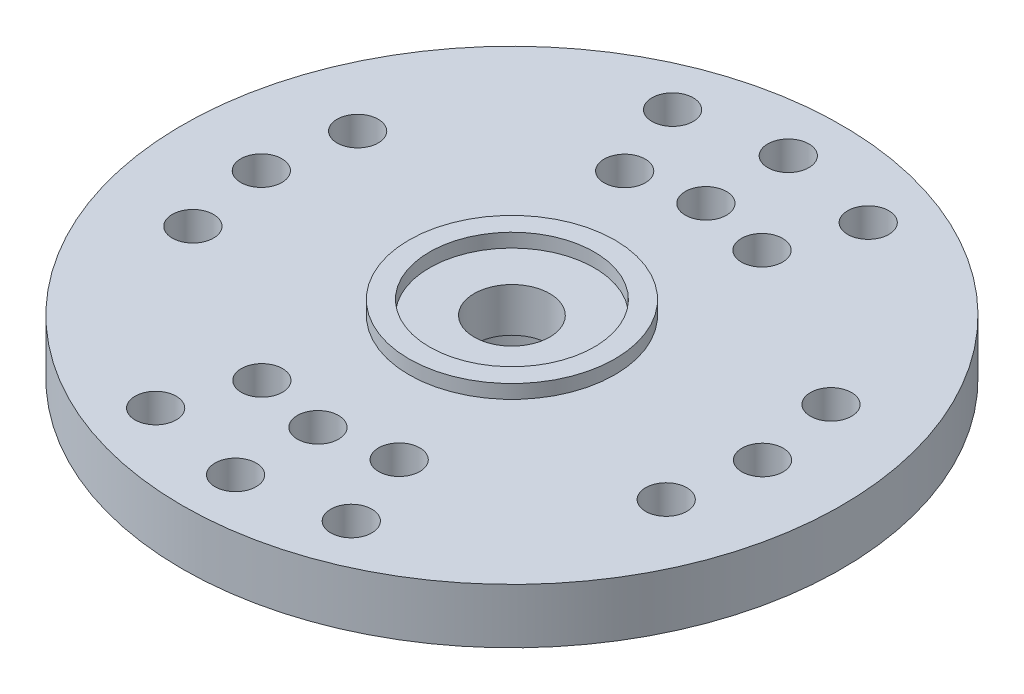
ISO-10303-21;
HEADER;
FILE_DESCRIPTION(('STEP AP214'),'2;1');
FILE_NAME('part.step','',(''),(''),'','','');
FILE_SCHEMA(('AUTOMOTIVE_DESIGN { 1 0 10303 214 1 1 1 1 }'));
ENDSEC;
DATA;
#1=APPLICATION_CONTEXT('core data for automotive mechanical design processes');
#2=APPLICATION_PROTOCOL_DEFINITION('international standard','automotive_design',2000,#1);
#3=PRODUCT_CONTEXT('',#1,'mechanical');
#4=PRODUCT('Part','Part','',(#3));
#5=PRODUCT_RELATED_PRODUCT_CATEGORY('part','',(#4));
#6=PRODUCT_DEFINITION_FORMATION('','',#4);
#7=PRODUCT_DEFINITION_CONTEXT('part definition',#1,'design');
#8=PRODUCT_DEFINITION('design','',#6,#7);
#9=PRODUCT_DEFINITION_SHAPE('','',#8);
#10=(LENGTH_UNIT() NAMED_UNIT(*) SI_UNIT(.MILLI.,.METRE.));
#11=(NAMED_UNIT(*) PLANE_ANGLE_UNIT() SI_UNIT($,.RADIAN.));
#12=(NAMED_UNIT(*) SI_UNIT($,.STERADIAN.) SOLID_ANGLE_UNIT());
#13=UNCERTAINTY_MEASURE_WITH_UNIT(LENGTH_MEASURE(1.E-05),#10,'distance_accuracy_value','');
#14=(GEOMETRIC_REPRESENTATION_CONTEXT(3) GLOBAL_UNCERTAINTY_ASSIGNED_CONTEXT((#13)) GLOBAL_UNIT_ASSIGNED_CONTEXT((#10,
#11,#12)) REPRESENTATION_CONTEXT('',''));
#15=CARTESIAN_POINT('',(0.,0.,0.));
#16=DIRECTION('',(0.,0.,1.));
#17=DIRECTION('',(1.,0.,0.));
#18=AXIS2_PLACEMENT_3D('',#15,#16,#17);
#19=CARTESIAN_POINT('',(0.,0.4,0.));
#20=DIRECTION('',(0.,1.,0.));
#21=DIRECTION('',(0.,0.,1.));
#22=AXIS2_PLACEMENT_3D('',#19,#20,#21);
#23=PLANE('',#22);
#24=CARTESIAN_POINT('',(0.,0.4,0.));
#25=DIRECTION('',(0.,1.,0.));
#26=DIRECTION('',(0.,0.,1.));
#27=AXIS2_PLACEMENT_3D('',#24,#25,#26);
#28=CIRCLE('',#27,1.375);
#29=CARTESIAN_POINT('',(0.,0.4,1.375));
#30=VERTEX_POINT('',#29);
#31=EDGE_CURVE('E16',#30,#30,#28,.T.);
#32=ORIENTED_EDGE('',*,*,#31,.T.);
#33=EDGE_LOOP('',(#32));
#34=FACE_BOUND('',#33,.T.);
#35=CARTESIAN_POINT('',(0.,0.4,0.));
#36=DIRECTION('',(0.,1.,0.));
#37=DIRECTION('',(0.,0.,1.));
#38=AXIS2_PLACEMENT_3D('',#35,#36,#37);
#39=CIRCLE('',#38,2.85);
#40=CARTESIAN_POINT('',(0.,0.4,2.85));
#41=VERTEX_POINT('',#40);
#42=EDGE_CURVE('E158',#41,#41,#39,.F.);
#43=ORIENTED_EDGE('',*,*,#42,.T.);
#44=EDGE_LOOP('',(#43));
#45=FACE_BOUND('',#44,.T.);
#46=ADVANCED_FACE('F13',(#34,#45),#23,.F.);
#47=CARTESIAN_POINT('',(0.,-2.6,0.));
#48=DIRECTION('',(0.,1.,0.));
#49=DIRECTION('',(0.,0.,1.));
#50=AXIS2_PLACEMENT_3D('',#47,#48,#49);
#51=CYLINDRICAL_SURFACE('',#50,1.375);
#52=CARTESIAN_POINT('',(0.,2.,0.));
#53=DIRECTION('',(0.,1.,0.));
#54=DIRECTION('',(0.,0.,1.));
#55=AXIS2_PLACEMENT_3D('',#52,#53,#54);
#56=CIRCLE('',#55,1.375);
#57=CARTESIAN_POINT('',(0.,2.,1.375));
#58=VERTEX_POINT('',#57);
#59=EDGE_CURVE('E156',#58,#58,#56,.F.);
#60=ORIENTED_EDGE('',*,*,#59,.F.);
#61=EDGE_LOOP('',(#60));
#62=FACE_BOUND('',#61,.T.);
#63=ORIENTED_EDGE('',*,*,#31,.F.);
#64=EDGE_LOOP('',(#63));
#65=FACE_BOUND('',#64,.T.);
#66=ADVANCED_FACE('F166',(#62,#65),#51,.F.);
#67=CARTESIAN_POINT('',(0.,-2.6,0.));
#68=DIRECTION('',(0.,1.,0.));
#69=DIRECTION('',(0.,0.,1.));
#70=AXIS2_PLACEMENT_3D('',#67,#68,#69);
#71=CYLINDRICAL_SURFACE('',#70,2.85);
#72=ORIENTED_EDGE('',*,*,#42,.F.);
#73=EDGE_LOOP('',(#72));
#74=FACE_BOUND('',#73,.T.);
#75=CARTESIAN_POINT('',(0.,-2.6,0.));
#76=DIRECTION('',(0.,1.,0.));
#77=DIRECTION('',(0.,0.,1.));
#78=AXIS2_PLACEMENT_3D('',#75,#76,#77);
#79=CIRCLE('',#78,2.85);
#80=CARTESIAN_POINT('',(0.,-2.6,2.85));
#81=VERTEX_POINT('',#80);
#82=EDGE_CURVE('E153',#81,#81,#79,.F.);
#83=ORIENTED_EDGE('',*,*,#82,.T.);
#84=EDGE_LOOP('',(#83));
#85=FACE_BOUND('',#84,.T.);
#86=ADVANCED_FACE('F168',(#74,#85),#71,.F.);
#87=CARTESIAN_POINT('',(0.,2.,0.));
#88=DIRECTION('',(0.,1.,0.));
#89=DIRECTION('',(0.,0.,1.));
#90=AXIS2_PLACEMENT_3D('',#87,#88,#89);
#91=PLANE('',#90);
#92=ORIENTED_EDGE('',*,*,#59,.T.);
#93=EDGE_LOOP('',(#92));
#94=FACE_BOUND('',#93,.T.);
#95=CARTESIAN_POINT('',(0.,2.,0.));
#96=DIRECTION('',(0.,1.,0.));
#97=DIRECTION('',(0.,0.,1.));
#98=AXIS2_PLACEMENT_3D('',#95,#96,#97);
#99=CIRCLE('',#98,3.);
#100=CARTESIAN_POINT('',(0.,2.,3.));
#101=VERTEX_POINT('',#100);
#102=EDGE_CURVE('E150',#101,#101,#99,.T.);
#103=ORIENTED_EDGE('',*,*,#102,.T.);
#104=EDGE_LOOP('',(#103));
#105=FACE_BOUND('',#104,.T.);
#106=ADVANCED_FACE('F175',(#94,#105),#91,.T.);
#107=CARTESIAN_POINT('',(0.,-2.6,0.));
#108=DIRECTION('',(0.,1.,0.));
#109=DIRECTION('',(0.,0.,1.));
#110=AXIS2_PLACEMENT_3D('',#107,#108,#109);
#111=PLANE('',#110);
#112=ORIENTED_EDGE('',*,*,#82,.F.);
#113=EDGE_LOOP('',(#112));
#114=FACE_BOUND('',#113,.T.);
#115=CARTESIAN_POINT('',(0.,-2.6,0.));
#116=DIRECTION('',(0.,1.,0.));
#117=DIRECTION('',(0.,0.,1.));
#118=AXIS2_PLACEMENT_3D('',#115,#116,#117);
#119=CIRCLE('',#118,4.45);
#120=CARTESIAN_POINT('',(0.,-2.6,4.45));
#121=VERTEX_POINT('',#120);
#122=EDGE_CURVE('E147',#121,#121,#119,.T.);
#123=ORIENTED_EDGE('',*,*,#122,.F.);
#124=EDGE_LOOP('',(#123));
#125=FACE_BOUND('',#124,.T.);
#126=ADVANCED_FACE('F281',(#114,#125),#111,.F.);
#127=CARTESIAN_POINT('',(0.,2.,0.));
#128=DIRECTION('',(0.,1.,0.));
#129=DIRECTION('',(0.,0.,1.));
#130=AXIS2_PLACEMENT_3D('',#127,#128,#129);
#131=CYLINDRICAL_SURFACE('',#130,3.);
#132=CARTESIAN_POINT('',(0.,2.5,0.));
#133=DIRECTION('',(0.,1.,0.));
#134=DIRECTION('',(0.,0.,1.));
#135=AXIS2_PLACEMENT_3D('',#132,#133,#134);
#136=CIRCLE('',#135,3.);
#137=CARTESIAN_POINT('',(0.,2.5,3.));
#138=VERTEX_POINT('',#137);
#139=EDGE_CURVE('E144',#138,#138,#136,.F.);
#140=ORIENTED_EDGE('',*,*,#139,.F.);
#141=EDGE_LOOP('',(#140));
#142=FACE_BOUND('',#141,.T.);
#143=ORIENTED_EDGE('',*,*,#102,.F.);
#144=EDGE_LOOP('',(#143));
#145=FACE_BOUND('',#144,.T.);
#146=ADVANCED_FACE('F277',(#142,#145),#131,.F.);
#147=CARTESIAN_POINT('',(0.,0.,0.));
#148=DIRECTION('',(0.,1.,0.));
#149=DIRECTION('',(0.,0.,1.));
#150=AXIS2_PLACEMENT_3D('',#147,#148,#149);
#151=CYLINDRICAL_SURFACE('',#150,4.45);
#152=ORIENTED_EDGE('',*,*,#122,.T.);
#153=EDGE_LOOP('',(#152));
#154=FACE_BOUND('',#153,.T.);
#155=CARTESIAN_POINT('',(0.,0.,0.));
#156=DIRECTION('',(0.,1.,0.));
#157=DIRECTION('',(0.,0.,1.));
#158=AXIS2_PLACEMENT_3D('',#155,#156,#157);
#159=CIRCLE('',#158,4.45);
#160=CARTESIAN_POINT('',(0.,0.,4.45));
#161=VERTEX_POINT('',#160);
#162=EDGE_CURVE('E141',#161,#161,#159,.F.);
#163=ORIENTED_EDGE('',*,*,#162,.T.);
#164=EDGE_LOOP('',(#163));
#165=FACE_BOUND('',#164,.T.);
#166=ADVANCED_FACE('F273',(#154,#165),#151,.T.);
#167=CARTESIAN_POINT('',(0.,2.5,0.));
#168=DIRECTION('',(0.,1.,0.));
#169=DIRECTION('',(0.,0.,1.));
#170=AXIS2_PLACEMENT_3D('',#167,#168,#169);
#171=PLANE('',#170);
#172=ORIENTED_EDGE('',*,*,#139,.T.);
#173=EDGE_LOOP('',(#172));
#174=FACE_BOUND('',#173,.T.);
#175=CARTESIAN_POINT('',(0.,2.5,0.));
#176=DIRECTION('',(0.,1.,0.));
#177=DIRECTION('',(0.,0.,1.));
#178=AXIS2_PLACEMENT_3D('',#175,#176,#177);
#179=CIRCLE('',#178,3.75);
#180=CARTESIAN_POINT('',(0.,2.5,3.75));
#181=VERTEX_POINT('',#180);
#182=EDGE_CURVE('E135',#181,#181,#179,.F.);
#183=ORIENTED_EDGE('',*,*,#182,.F.);
#184=EDGE_LOOP('',(#183));
#185=FACE_BOUND('',#184,.T.);
#186=ADVANCED_FACE('F269',(#174,#185),#171,.T.);
#187=CARTESIAN_POINT('',(0.,0.,0.));
#188=DIRECTION('',(0.,1.,0.));
#189=DIRECTION('',(0.,0.,1.));
#190=AXIS2_PLACEMENT_3D('',#187,#188,#189);
#191=PLANE('',#190);
#192=CARTESIAN_POINT('',(-3.56194690265486,0.,9.41097447200168));
#193=DIRECTION('',(0.,1.,0.));
#194=DIRECTION('',(0.,0.,1.));
#195=AXIS2_PLACEMENT_3D('',#192,#193,#194);
#196=CIRCLE('',#195,0.75);
#197=CARTESIAN_POINT('',(-3.56194690265486,0.,10.1609744720017));
#198=VERTEX_POINT('',#197);
#199=EDGE_CURVE('E81',#198,#198,#196,.T.);
#200=ORIENTED_EDGE('',*,*,#199,.T.);
#201=EDGE_LOOP('',(#200));
#202=FACE_BOUND('',#201,.T.);
#203=CARTESIAN_POINT('',(3.56194690265486,0.,9.41097447200168));
#204=DIRECTION('',(0.,1.,0.));
#205=DIRECTION('',(0.,0.,1.));
#206=AXIS2_PLACEMENT_3D('',#203,#204,#205);
#207=CIRCLE('',#206,0.75);
#208=CARTESIAN_POINT('',(3.56194690265486,0.,10.1609744720017));
#209=VERTEX_POINT('',#208);
#210=EDGE_CURVE('E84',#209,#209,#207,.T.);
#211=ORIENTED_EDGE('',*,*,#210,.T.);
#212=EDGE_LOOP('',(#211));
#213=FACE_BOUND('',#212,.T.);
#214=CARTESIAN_POINT('',(-3.56194690265486,0.,-9.41097447200168));
#215=DIRECTION('',(0.,1.,0.));
#216=DIRECTION('',(0.,0.,1.));
#217=AXIS2_PLACEMENT_3D('',#214,#215,#216);
#218=CIRCLE('',#217,0.75);
#219=CARTESIAN_POINT('',(-3.56194690265486,0.,-8.66097447200168));
#220=VERTEX_POINT('',#219);
#221=EDGE_CURVE('E87',#220,#220,#218,.T.);
#222=ORIENTED_EDGE('',*,*,#221,.T.);
#223=EDGE_LOOP('',(#222));
#224=FACE_BOUND('',#223,.T.);
#225=CARTESIAN_POINT('',(3.56194690265486,0.,-9.41097447200168));
#226=DIRECTION('',(0.,1.,0.));
#227=DIRECTION('',(0.,0.,1.));
#228=AXIS2_PLACEMENT_3D('',#225,#226,#227);
#229=CIRCLE('',#228,0.75);
#230=CARTESIAN_POINT('',(3.56194690265486,0.,-8.66097447200168));
#231=VERTEX_POINT('',#230);
#232=EDGE_CURVE('E90',#231,#231,#229,.T.);
#233=ORIENTED_EDGE('',*,*,#232,.T.);
#234=EDGE_LOOP('',(#233));
#235=FACE_BOUND('',#234,.T.);
#236=CARTESIAN_POINT('',(0.,0.,10.0625));
#237=DIRECTION('',(0.,1.,0.));
#238=DIRECTION('',(0.,0.,1.));
#239=AXIS2_PLACEMENT_3D('',#236,#237,#238);
#240=CIRCLE('',#239,0.75);
#241=CARTESIAN_POINT('',(0.,0.,10.8125));
#242=VERTEX_POINT('',#241);
#243=EDGE_CURVE('E93',#242,#242,#240,.T.);
#244=ORIENTED_EDGE('',*,*,#243,.T.);
#245=EDGE_LOOP('',(#244));
#246=FACE_BOUND('',#245,.T.);
#247=CARTESIAN_POINT('',(0.,0.,-10.0625));
#248=DIRECTION('',(0.,1.,0.));
#249=DIRECTION('',(0.,0.,1.));
#250=AXIS2_PLACEMENT_3D('',#247,#248,#249);
#251=CIRCLE('',#250,0.75);
#252=CARTESIAN_POINT('',(0.,0.,-9.31249999999999));
#253=VERTEX_POINT('',#252);
#254=EDGE_CURVE('E96',#253,#253,#251,.T.);
#255=ORIENTED_EDGE('',*,*,#254,.T.);
#256=EDGE_LOOP('',(#255));
#257=FACE_BOUND('',#256,.T.);
#258=CARTESIAN_POINT('',(-2.5,0.,6.60521810767821));
#259=DIRECTION('',(0.,1.,0.));
#260=DIRECTION('',(0.,0.,1.));
#261=AXIS2_PLACEMENT_3D('',#258,#259,#260);
#262=CIRCLE('',#261,0.75);
#263=CARTESIAN_POINT('',(-2.5,0.,7.35521810767821));
#264=VERTEX_POINT('',#263);
#265=EDGE_CURVE('E99',#264,#264,#262,.T.);
#266=ORIENTED_EDGE('',*,*,#265,.T.);
#267=EDGE_LOOP('',(#266));
#268=FACE_BOUND('',#267,.T.);
#269=CARTESIAN_POINT('',(2.5,0.,6.60521810767821));
#270=DIRECTION('',(0.,1.,0.));
#271=DIRECTION('',(0.,0.,1.));
#272=AXIS2_PLACEMENT_3D('',#269,#270,#271);
#273=CIRCLE('',#272,0.75);
#274=CARTESIAN_POINT('',(2.5,0.,7.35521810767821));
#275=VERTEX_POINT('',#274);
#276=EDGE_CURVE('E102',#275,#275,#273,.T.);
#277=ORIENTED_EDGE('',*,*,#276,.T.);
#278=EDGE_LOOP('',(#277));
#279=FACE_BOUND('',#278,.T.);
#280=CARTESIAN_POINT('',(-2.5,0.,-6.60521810767821));
#281=DIRECTION('',(0.,1.,0.));
#282=DIRECTION('',(0.,0.,1.));
#283=AXIS2_PLACEMENT_3D('',#280,#281,#282);
#284=CIRCLE('',#283,0.75);
#285=CARTESIAN_POINT('',(-2.5,0.,-5.85521810767821));
#286=VERTEX_POINT('',#285);
#287=EDGE_CURVE('E105',#286,#286,#284,.T.);
#288=ORIENTED_EDGE('',*,*,#287,.T.);
#289=EDGE_LOOP('',(#288));
#290=FACE_BOUND('',#289,.T.);
#291=CARTESIAN_POINT('',(2.5,0.,-6.60521810767821));
#292=DIRECTION('',(0.,1.,0.));
#293=DIRECTION('',(0.,0.,1.));
#294=AXIS2_PLACEMENT_3D('',#291,#292,#293);
#295=CIRCLE('',#294,0.75);
#296=CARTESIAN_POINT('',(2.5,0.,-5.85521810767821));
#297=VERTEX_POINT('',#296);
#298=EDGE_CURVE('E108',#297,#297,#295,.T.);
#299=ORIENTED_EDGE('',*,*,#298,.T.);
#300=EDGE_LOOP('',(#299));
#301=FACE_BOUND('',#300,.T.);
#302=CARTESIAN_POINT('',(0.,0.,7.0625));
#303=DIRECTION('',(0.,1.,0.));
#304=DIRECTION('',(0.,0.,1.));
#305=AXIS2_PLACEMENT_3D('',#302,#303,#304);
#306=CIRCLE('',#305,0.75);
#307=CARTESIAN_POINT('',(0.,0.,7.8125));
#308=VERTEX_POINT('',#307);
#309=EDGE_CURVE('E111',#308,#308,#306,.T.);
#310=ORIENTED_EDGE('',*,*,#309,.T.);
#311=EDGE_LOOP('',(#310));
#312=FACE_BOUND('',#311,.T.);
#313=CARTESIAN_POINT('',(0.,0.,-7.0625));
#314=DIRECTION('',(0.,1.,0.));
#315=DIRECTION('',(0.,0.,1.));
#316=AXIS2_PLACEMENT_3D('',#313,#314,#315);
#317=CIRCLE('',#316,0.75);
#318=CARTESIAN_POINT('',(0.,0.,-6.3125));
#319=VERTEX_POINT('',#318);
#320=EDGE_CURVE('E114',#319,#319,#317,.T.);
#321=ORIENTED_EDGE('',*,*,#320,.T.);
#322=EDGE_LOOP('',(#321));
#323=FACE_BOUND('',#322,.T.);
#324=CARTESIAN_POINT('',(-8.61775057657159,0.,-3.));
#325=DIRECTION('',(0.,1.,0.));
#326=DIRECTION('',(0.,0.,1.));
#327=AXIS2_PLACEMENT_3D('',#324,#325,#326);
#328=CIRCLE('',#327,0.75);
#329=CARTESIAN_POINT('',(-8.61775057657159,0.,-2.25));
#330=VERTEX_POINT('',#329);
#331=EDGE_CURVE('E117',#330,#330,#328,.T.);
#332=ORIENTED_EDGE('',*,*,#331,.T.);
#333=EDGE_LOOP('',(#332));
#334=FACE_BOUND('',#333,.T.);
#335=CARTESIAN_POINT('',(-8.61775057657159,0.,3.));
#336=DIRECTION('',(0.,1.,0.));
#337=DIRECTION('',(0.,0.,1.));
#338=AXIS2_PLACEMENT_3D('',#335,#336,#337);
#339=CIRCLE('',#338,0.75);
#340=CARTESIAN_POINT('',(-8.61775057657159,0.,3.75));
#341=VERTEX_POINT('',#340);
#342=EDGE_CURVE('E120',#341,#341,#339,.T.);
#343=ORIENTED_EDGE('',*,*,#342,.T.);
#344=EDGE_LOOP('',(#343));
#345=FACE_BOUND('',#344,.T.);
#346=CARTESIAN_POINT('',(8.61775057657159,0.,-3.));
#347=DIRECTION('',(0.,1.,0.));
#348=DIRECTION('',(0.,0.,1.));
#349=AXIS2_PLACEMENT_3D('',#346,#347,#348);
#350=CIRCLE('',#349,0.75);
#351=CARTESIAN_POINT('',(8.61775057657159,0.,-2.25));
#352=VERTEX_POINT('',#351);
#353=EDGE_CURVE('E123',#352,#352,#350,.T.);
#354=ORIENTED_EDGE('',*,*,#353,.T.);
#355=EDGE_LOOP('',(#354));
#356=FACE_BOUND('',#355,.T.);
#357=CARTESIAN_POINT('',(8.61775057657159,0.,3.));
#358=DIRECTION('',(0.,1.,0.));
#359=DIRECTION('',(0.,0.,1.));
#360=AXIS2_PLACEMENT_3D('',#357,#358,#359);
#361=CIRCLE('',#360,0.75);
#362=CARTESIAN_POINT('',(8.61775057657159,0.,3.75));
#363=VERTEX_POINT('',#362);
#364=EDGE_CURVE('E126',#363,#363,#361,.T.);
#365=ORIENTED_EDGE('',*,*,#364,.T.);
#366=EDGE_LOOP('',(#365));
#367=FACE_BOUND('',#366,.T.);
#368=CARTESIAN_POINT('',(-9.125,0.,0.));
#369=DIRECTION('',(0.,1.,0.));
#370=DIRECTION('',(0.,0.,1.));
#371=AXIS2_PLACEMENT_3D('',#368,#369,#370);
#372=CIRCLE('',#371,0.75);
#373=CARTESIAN_POINT('',(-9.125,0.,0.75));
#374=VERTEX_POINT('',#373);
#375=EDGE_CURVE('E129',#374,#374,#372,.T.);
#376=ORIENTED_EDGE('',*,*,#375,.T.);
#377=EDGE_LOOP('',(#376));
#378=FACE_BOUND('',#377,.T.);
#379=CARTESIAN_POINT('',(9.125,0.,0.));
#380=DIRECTION('',(0.,1.,0.));
#381=DIRECTION('',(0.,0.,1.));
#382=AXIS2_PLACEMENT_3D('',#379,#380,#381);
#383=CIRCLE('',#382,0.75);
#384=CARTESIAN_POINT('',(9.125,0.,0.75));
#385=VERTEX_POINT('',#384);
#386=EDGE_CURVE('E132',#385,#385,#383,.T.);
#387=ORIENTED_EDGE('',*,*,#386,.T.);
#388=EDGE_LOOP('',(#387));
#389=FACE_BOUND('',#388,.T.);
#390=ORIENTED_EDGE('',*,*,#162,.F.);
#391=EDGE_LOOP('',(#390));
#392=FACE_BOUND('',#391,.T.);
#393=CARTESIAN_POINT('',(0.,0.,0.));
#394=DIRECTION('',(0.,1.,0.));
#395=DIRECTION('',(0.,0.,1.));
#396=AXIS2_PLACEMENT_3D('',#393,#394,#395);
#397=CIRCLE('',#396,12.);
#398=CARTESIAN_POINT('',(0.,0.,12.));
#399=VERTEX_POINT('',#398);
#400=EDGE_CURVE('E138',#399,#399,#397,.T.);
#401=ORIENTED_EDGE('',*,*,#400,.F.);
#402=EDGE_LOOP('',(#401));
#403=FACE_BOUND('',#402,.T.);
#404=ADVANCED_FACE('F265',(#202,#213,#224,#235,#246,#257,#268,#279,#290,#301,#312,#323,#334,
#345,#356,#367,#378,#389,#392,#403),#191,.F.);
#405=CARTESIAN_POINT('',(0.,0.,0.));
#406=DIRECTION('',(0.,1.,0.));
#407=DIRECTION('',(0.,0.,1.));
#408=AXIS2_PLACEMENT_3D('',#405,#406,#407);
#409=CYLINDRICAL_SURFACE('',#408,12.);
#410=CARTESIAN_POINT('',(0.,2.,0.));
#411=DIRECTION('',(0.,1.,0.));
#412=DIRECTION('',(0.,0.,1.));
#413=AXIS2_PLACEMENT_3D('',#410,#411,#412);
#414=CIRCLE('',#413,12.);
#415=CARTESIAN_POINT('',(0.,2.,12.));
#416=VERTEX_POINT('',#415);
#417=EDGE_CURVE('E78',#416,#416,#414,.T.);
#418=ORIENTED_EDGE('',*,*,#417,.F.);
#419=EDGE_LOOP('',(#418));
#420=FACE_BOUND('',#419,.T.);
#421=ORIENTED_EDGE('',*,*,#400,.T.);
#422=EDGE_LOOP('',(#421));
#423=FACE_BOUND('',#422,.T.);
#424=ADVANCED_FACE('F261',(#420,#423),#409,.T.);
#425=CARTESIAN_POINT('',(0.,2.,0.));
#426=DIRECTION('',(0.,1.,0.));
#427=DIRECTION('',(0.,0.,1.));
#428=AXIS2_PLACEMENT_3D('',#425,#426,#427);
#429=CYLINDRICAL_SURFACE('',#428,3.75);
#430=ORIENTED_EDGE('',*,*,#182,.T.);
#431=EDGE_LOOP('',(#430));
#432=FACE_BOUND('',#431,.T.);
#433=CARTESIAN_POINT('',(0.,2.,0.));
#434=DIRECTION('',(0.,1.,0.));
#435=DIRECTION('',(0.,0.,1.));
#436=AXIS2_PLACEMENT_3D('',#433,#434,#435);
#437=CIRCLE('',#436,3.75);
#438=CARTESIAN_POINT('',(0.,2.,3.75));
#439=VERTEX_POINT('',#438);
#440=EDGE_CURVE('E75',#439,#439,#437,.F.);
#441=ORIENTED_EDGE('',*,*,#440,.F.);
#442=EDGE_LOOP('',(#441));
#443=FACE_BOUND('',#442,.T.);
#444=ADVANCED_FACE('F257',(#432,#443),#429,.T.);
#445=CARTESIAN_POINT('',(9.125,2.,0.));
#446=DIRECTION('',(0.,1.,0.));
#447=DIRECTION('',(0.,0.,1.));
#448=AXIS2_PLACEMENT_3D('',#445,#446,#447);
#449=CYLINDRICAL_SURFACE('',#448,0.75);
#450=CARTESIAN_POINT('',(9.125,2.,0.));
#451=DIRECTION('',(0.,1.,0.));
#452=DIRECTION('',(0.,0.,1.));
#453=AXIS2_PLACEMENT_3D('',#450,#451,#452);
#454=CIRCLE('',#453,0.75);
#455=CARTESIAN_POINT('',(9.125,2.,0.75));
#456=VERTEX_POINT('',#455);
#457=EDGE_CURVE('E72',#456,#456,#454,.F.);
#458=ORIENTED_EDGE('',*,*,#457,.F.);
#459=EDGE_LOOP('',(#458));
#460=FACE_BOUND('',#459,.T.);
#461=ORIENTED_EDGE('',*,*,#386,.F.);
#462=EDGE_LOOP('',(#461));
#463=FACE_BOUND('',#462,.T.);
#464=ADVANCED_FACE('F253',(#460,#463),#449,.F.);
#465=CARTESIAN_POINT('',(-9.125,2.,0.));
#466=DIRECTION('',(0.,1.,0.));
#467=DIRECTION('',(0.,0.,1.));
#468=AXIS2_PLACEMENT_3D('',#465,#466,#467);
#469=CYLINDRICAL_SURFACE('',#468,0.75);
#470=CARTESIAN_POINT('',(-9.125,2.,0.));
#471=DIRECTION('',(0.,1.,0.));
#472=DIRECTION('',(0.,0.,1.));
#473=AXIS2_PLACEMENT_3D('',#470,#471,#472);
#474=CIRCLE('',#473,0.75);
#475=CARTESIAN_POINT('',(-9.125,2.,0.75));
#476=VERTEX_POINT('',#475);
#477=EDGE_CURVE('E69',#476,#476,#474,.F.);
#478=ORIENTED_EDGE('',*,*,#477,.F.);
#479=EDGE_LOOP('',(#478));
#480=FACE_BOUND('',#479,.T.);
#481=ORIENTED_EDGE('',*,*,#375,.F.);
#482=EDGE_LOOP('',(#481));
#483=FACE_BOUND('',#482,.T.);
#484=ADVANCED_FACE('F249',(#480,#483),#469,.F.);
#485=CARTESIAN_POINT('',(8.61775057657159,2.,3.));
#486=DIRECTION('',(0.,1.,0.));
#487=DIRECTION('',(0.,0.,1.));
#488=AXIS2_PLACEMENT_3D('',#485,#486,#487);
#489=CYLINDRICAL_SURFACE('',#488,0.75);
#490=CARTESIAN_POINT('',(8.61775057657159,2.,3.));
#491=DIRECTION('',(0.,1.,0.));
#492=DIRECTION('',(0.,0.,1.));
#493=AXIS2_PLACEMENT_3D('',#490,#491,#492);
#494=CIRCLE('',#493,0.75);
#495=CARTESIAN_POINT('',(8.61775057657159,2.,3.75));
#496=VERTEX_POINT('',#495);
#497=EDGE_CURVE('E66',#496,#496,#494,.F.);
#498=ORIENTED_EDGE('',*,*,#497,.F.);
#499=EDGE_LOOP('',(#498));
#500=FACE_BOUND('',#499,.T.);
#501=ORIENTED_EDGE('',*,*,#364,.F.);
#502=EDGE_LOOP('',(#501));
#503=FACE_BOUND('',#502,.T.);
#504=ADVANCED_FACE('F245',(#500,#503),#489,.F.);
#505=CARTESIAN_POINT('',(8.61775057657159,2.,-3.));
#506=DIRECTION('',(0.,1.,0.));
#507=DIRECTION('',(0.,0.,1.));
#508=AXIS2_PLACEMENT_3D('',#505,#506,#507);
#509=CYLINDRICAL_SURFACE('',#508,0.75);
#510=CARTESIAN_POINT('',(8.61775057657159,2.,-3.));
#511=DIRECTION('',(0.,1.,0.));
#512=DIRECTION('',(0.,0.,1.));
#513=AXIS2_PLACEMENT_3D('',#510,#511,#512);
#514=CIRCLE('',#513,0.75);
#515=CARTESIAN_POINT('',(8.61775057657159,2.,-2.25));
#516=VERTEX_POINT('',#515);
#517=EDGE_CURVE('E63',#516,#516,#514,.F.);
#518=ORIENTED_EDGE('',*,*,#517,.F.);
#519=EDGE_LOOP('',(#518));
#520=FACE_BOUND('',#519,.T.);
#521=ORIENTED_EDGE('',*,*,#353,.F.);
#522=EDGE_LOOP('',(#521));
#523=FACE_BOUND('',#522,.T.);
#524=ADVANCED_FACE('F241',(#520,#523),#509,.F.);
#525=CARTESIAN_POINT('',(-8.61775057657159,2.,3.));
#526=DIRECTION('',(0.,1.,0.));
#527=DIRECTION('',(0.,0.,1.));
#528=AXIS2_PLACEMENT_3D('',#525,#526,#527);
#529=CYLINDRICAL_SURFACE('',#528,0.75);
#530=CARTESIAN_POINT('',(-8.61775057657159,2.,3.));
#531=DIRECTION('',(0.,1.,0.));
#532=DIRECTION('',(0.,0.,1.));
#533=AXIS2_PLACEMENT_3D('',#530,#531,#532);
#534=CIRCLE('',#533,0.75);
#535=CARTESIAN_POINT('',(-8.61775057657159,2.,3.75));
#536=VERTEX_POINT('',#535);
#537=EDGE_CURVE('E60',#536,#536,#534,.F.);
#538=ORIENTED_EDGE('',*,*,#537,.F.);
#539=EDGE_LOOP('',(#538));
#540=FACE_BOUND('',#539,.T.);
#541=ORIENTED_EDGE('',*,*,#342,.F.);
#542=EDGE_LOOP('',(#541));
#543=FACE_BOUND('',#542,.T.);
#544=ADVANCED_FACE('F237',(#540,#543),#529,.F.);
#545=CARTESIAN_POINT('',(-8.61775057657159,2.,-3.));
#546=DIRECTION('',(0.,1.,0.));
#547=DIRECTION('',(0.,0.,1.));
#548=AXIS2_PLACEMENT_3D('',#545,#546,#547);
#549=CYLINDRICAL_SURFACE('',#548,0.75);
#550=CARTESIAN_POINT('',(-8.61775057657159,2.,-3.));
#551=DIRECTION('',(0.,1.,0.));
#552=DIRECTION('',(0.,0.,1.));
#553=AXIS2_PLACEMENT_3D('',#550,#551,#552);
#554=CIRCLE('',#553,0.75);
#555=CARTESIAN_POINT('',(-8.61775057657159,2.,-2.25));
#556=VERTEX_POINT('',#555);
#557=EDGE_CURVE('E57',#556,#556,#554,.F.);
#558=ORIENTED_EDGE('',*,*,#557,.F.);
#559=EDGE_LOOP('',(#558));
#560=FACE_BOUND('',#559,.T.);
#561=ORIENTED_EDGE('',*,*,#331,.F.);
#562=EDGE_LOOP('',(#561));
#563=FACE_BOUND('',#562,.T.);
#564=ADVANCED_FACE('F233',(#560,#563),#549,.F.);
#565=CARTESIAN_POINT('',(0.,2.,-7.0625));
#566=DIRECTION('',(0.,1.,0.));
#567=DIRECTION('',(0.,0.,1.));
#568=AXIS2_PLACEMENT_3D('',#565,#566,#567);
#569=CYLINDRICAL_SURFACE('',#568,0.75);
#570=CARTESIAN_POINT('',(0.,2.,-7.0625));
#571=DIRECTION('',(0.,1.,0.));
#572=DIRECTION('',(0.,0.,1.));
#573=AXIS2_PLACEMENT_3D('',#570,#571,#572);
#574=CIRCLE('',#573,0.75);
#575=CARTESIAN_POINT('',(0.,2.,-6.3125));
#576=VERTEX_POINT('',#575);
#577=EDGE_CURVE('E54',#576,#576,#574,.F.);
#578=ORIENTED_EDGE('',*,*,#577,.F.);
#579=EDGE_LOOP('',(#578));
#580=FACE_BOUND('',#579,.T.);
#581=ORIENTED_EDGE('',*,*,#320,.F.);
#582=EDGE_LOOP('',(#581));
#583=FACE_BOUND('',#582,.T.);
#584=ADVANCED_FACE('F229',(#580,#583),#569,.F.);
#585=CARTESIAN_POINT('',(0.,2.,7.0625));
#586=DIRECTION('',(0.,1.,0.));
#587=DIRECTION('',(0.,0.,1.));
#588=AXIS2_PLACEMENT_3D('',#585,#586,#587);
#589=CYLINDRICAL_SURFACE('',#588,0.75);
#590=CARTESIAN_POINT('',(0.,2.,7.0625));
#591=DIRECTION('',(0.,1.,0.));
#592=DIRECTION('',(0.,0.,1.));
#593=AXIS2_PLACEMENT_3D('',#590,#591,#592);
#594=CIRCLE('',#593,0.75);
#595=CARTESIAN_POINT('',(0.,2.,7.8125));
#596=VERTEX_POINT('',#595);
#597=EDGE_CURVE('E51',#596,#596,#594,.F.);
#598=ORIENTED_EDGE('',*,*,#597,.F.);
#599=EDGE_LOOP('',(#598));
#600=FACE_BOUND('',#599,.T.);
#601=ORIENTED_EDGE('',*,*,#309,.F.);
#602=EDGE_LOOP('',(#601));
#603=FACE_BOUND('',#602,.T.);
#604=ADVANCED_FACE('F225',(#600,#603),#589,.F.);
#605=CARTESIAN_POINT('',(2.5,2.,-6.60521810767821));
#606=DIRECTION('',(0.,1.,0.));
#607=DIRECTION('',(0.,0.,1.));
#608=AXIS2_PLACEMENT_3D('',#605,#606,#607);
#609=CYLINDRICAL_SURFACE('',#608,0.75);
#610=CARTESIAN_POINT('',(2.5,2.,-6.60521810767821));
#611=DIRECTION('',(0.,1.,0.));
#612=DIRECTION('',(0.,0.,1.));
#613=AXIS2_PLACEMENT_3D('',#610,#611,#612);
#614=CIRCLE('',#613,0.75);
#615=CARTESIAN_POINT('',(2.5,2.,-5.85521810767821));
#616=VERTEX_POINT('',#615);
#617=EDGE_CURVE('E48',#616,#616,#614,.F.);
#618=ORIENTED_EDGE('',*,*,#617,.F.);
#619=EDGE_LOOP('',(#618));
#620=FACE_BOUND('',#619,.T.);
#621=ORIENTED_EDGE('',*,*,#298,.F.);
#622=EDGE_LOOP('',(#621));
#623=FACE_BOUND('',#622,.T.);
#624=ADVANCED_FACE('F221',(#620,#623),#609,.F.);
#625=CARTESIAN_POINT('',(-2.5,2.,-6.60521810767821));
#626=DIRECTION('',(0.,1.,0.));
#627=DIRECTION('',(0.,0.,1.));
#628=AXIS2_PLACEMENT_3D('',#625,#626,#627);
#629=CYLINDRICAL_SURFACE('',#628,0.75);
#630=CARTESIAN_POINT('',(-2.5,2.,-6.60521810767821));
#631=DIRECTION('',(0.,1.,0.));
#632=DIRECTION('',(0.,0.,1.));
#633=AXIS2_PLACEMENT_3D('',#630,#631,#632);
#634=CIRCLE('',#633,0.75);
#635=CARTESIAN_POINT('',(-2.5,2.,-5.85521810767821));
#636=VERTEX_POINT('',#635);
#637=EDGE_CURVE('E45',#636,#636,#634,.F.);
#638=ORIENTED_EDGE('',*,*,#637,.F.);
#639=EDGE_LOOP('',(#638));
#640=FACE_BOUND('',#639,.T.);
#641=ORIENTED_EDGE('',*,*,#287,.F.);
#642=EDGE_LOOP('',(#641));
#643=FACE_BOUND('',#642,.T.);
#644=ADVANCED_FACE('F217',(#640,#643),#629,.F.);
#645=CARTESIAN_POINT('',(2.5,2.,6.60521810767821));
#646=DIRECTION('',(0.,1.,0.));
#647=DIRECTION('',(0.,0.,1.));
#648=AXIS2_PLACEMENT_3D('',#645,#646,#647);
#649=CYLINDRICAL_SURFACE('',#648,0.75);
#650=CARTESIAN_POINT('',(2.5,2.,6.60521810767821));
#651=DIRECTION('',(0.,1.,0.));
#652=DIRECTION('',(0.,0.,1.));
#653=AXIS2_PLACEMENT_3D('',#650,#651,#652);
#654=CIRCLE('',#653,0.75);
#655=CARTESIAN_POINT('',(2.5,2.,7.35521810767821));
#656=VERTEX_POINT('',#655);
#657=EDGE_CURVE('E42',#656,#656,#654,.F.);
#658=ORIENTED_EDGE('',*,*,#657,.F.);
#659=EDGE_LOOP('',(#658));
#660=FACE_BOUND('',#659,.T.);
#661=ORIENTED_EDGE('',*,*,#276,.F.);
#662=EDGE_LOOP('',(#661));
#663=FACE_BOUND('',#662,.T.);
#664=ADVANCED_FACE('F213',(#660,#663),#649,.F.);
#665=CARTESIAN_POINT('',(-2.5,2.,6.60521810767821));
#666=DIRECTION('',(0.,1.,0.));
#667=DIRECTION('',(0.,0.,1.));
#668=AXIS2_PLACEMENT_3D('',#665,#666,#667);
#669=CYLINDRICAL_SURFACE('',#668,0.75);
#670=CARTESIAN_POINT('',(-2.5,2.,6.60521810767821));
#671=DIRECTION('',(0.,1.,0.));
#672=DIRECTION('',(0.,0.,1.));
#673=AXIS2_PLACEMENT_3D('',#670,#671,#672);
#674=CIRCLE('',#673,0.75);
#675=CARTESIAN_POINT('',(-2.5,2.,7.35521810767821));
#676=VERTEX_POINT('',#675);
#677=EDGE_CURVE('E39',#676,#676,#674,.F.);
#678=ORIENTED_EDGE('',*,*,#677,.F.);
#679=EDGE_LOOP('',(#678));
#680=FACE_BOUND('',#679,.T.);
#681=ORIENTED_EDGE('',*,*,#265,.F.);
#682=EDGE_LOOP('',(#681));
#683=FACE_BOUND('',#682,.T.);
#684=ADVANCED_FACE('F209',(#680,#683),#669,.F.);
#685=CARTESIAN_POINT('',(0.,2.,-10.0625));
#686=DIRECTION('',(0.,1.,0.));
#687=DIRECTION('',(0.,0.,1.));
#688=AXIS2_PLACEMENT_3D('',#685,#686,#687);
#689=CYLINDRICAL_SURFACE('',#688,0.75);
#690=CARTESIAN_POINT('',(0.,2.,-10.0625));
#691=DIRECTION('',(0.,1.,0.));
#692=DIRECTION('',(0.,0.,1.));
#693=AXIS2_PLACEMENT_3D('',#690,#691,#692);
#694=CIRCLE('',#693,0.75);
#695=CARTESIAN_POINT('',(0.,2.,-9.31249999999999));
#696=VERTEX_POINT('',#695);
#697=EDGE_CURVE('E36',#696,#696,#694,.F.);
#698=ORIENTED_EDGE('',*,*,#697,.F.);
#699=EDGE_LOOP('',(#698));
#700=FACE_BOUND('',#699,.T.);
#701=ORIENTED_EDGE('',*,*,#254,.F.);
#702=EDGE_LOOP('',(#701));
#703=FACE_BOUND('',#702,.T.);
#704=ADVANCED_FACE('F205',(#700,#703),#689,.F.);
#705=CARTESIAN_POINT('',(0.,2.,10.0625));
#706=DIRECTION('',(0.,1.,0.));
#707=DIRECTION('',(0.,0.,1.));
#708=AXIS2_PLACEMENT_3D('',#705,#706,#707);
#709=CYLINDRICAL_SURFACE('',#708,0.75);
#710=CARTESIAN_POINT('',(0.,2.,10.0625));
#711=DIRECTION('',(0.,1.,0.));
#712=DIRECTION('',(0.,0.,1.));
#713=AXIS2_PLACEMENT_3D('',#710,#711,#712);
#714=CIRCLE('',#713,0.75);
#715=CARTESIAN_POINT('',(0.,2.,10.8125));
#716=VERTEX_POINT('',#715);
#717=EDGE_CURVE('E33',#716,#716,#714,.F.);
#718=ORIENTED_EDGE('',*,*,#717,.F.);
#719=EDGE_LOOP('',(#718));
#720=FACE_BOUND('',#719,.T.);
#721=ORIENTED_EDGE('',*,*,#243,.F.);
#722=EDGE_LOOP('',(#721));
#723=FACE_BOUND('',#722,.T.);
#724=ADVANCED_FACE('F201',(#720,#723),#709,.F.);
#725=CARTESIAN_POINT('',(3.56194690265486,2.,-9.41097447200168));
#726=DIRECTION('',(0.,1.,0.));
#727=DIRECTION('',(0.,0.,1.));
#728=AXIS2_PLACEMENT_3D('',#725,#726,#727);
#729=CYLINDRICAL_SURFACE('',#728,0.75);
#730=CARTESIAN_POINT('',(3.56194690265486,2.,-9.41097447200168));
#731=DIRECTION('',(0.,1.,0.));
#732=DIRECTION('',(0.,0.,1.));
#733=AXIS2_PLACEMENT_3D('',#730,#731,#732);
#734=CIRCLE('',#733,0.75);
#735=CARTESIAN_POINT('',(3.56194690265486,2.,-8.66097447200168));
#736=VERTEX_POINT('',#735);
#737=EDGE_CURVE('E30',#736,#736,#734,.F.);
#738=ORIENTED_EDGE('',*,*,#737,.F.);
#739=EDGE_LOOP('',(#738));
#740=FACE_BOUND('',#739,.T.);
#741=ORIENTED_EDGE('',*,*,#232,.F.);
#742=EDGE_LOOP('',(#741));
#743=FACE_BOUND('',#742,.T.);
#744=ADVANCED_FACE('F197',(#740,#743),#729,.F.);
#745=CARTESIAN_POINT('',(-3.56194690265486,2.,-9.41097447200168));
#746=DIRECTION('',(0.,1.,0.));
#747=DIRECTION('',(0.,0.,1.));
#748=AXIS2_PLACEMENT_3D('',#745,#746,#747);
#749=CYLINDRICAL_SURFACE('',#748,0.75);
#750=CARTESIAN_POINT('',(-3.56194690265486,2.,-9.41097447200168));
#751=DIRECTION('',(0.,1.,0.));
#752=DIRECTION('',(0.,0.,1.));
#753=AXIS2_PLACEMENT_3D('',#750,#751,#752);
#754=CIRCLE('',#753,0.75);
#755=CARTESIAN_POINT('',(-3.56194690265486,2.,-8.66097447200168));
#756=VERTEX_POINT('',#755);
#757=EDGE_CURVE('E25',#756,#756,#754,.F.);
#758=ORIENTED_EDGE('',*,*,#757,.F.);
#759=EDGE_LOOP('',(#758));
#760=FACE_BOUND('',#759,.T.);
#761=ORIENTED_EDGE('',*,*,#221,.F.);
#762=EDGE_LOOP('',(#761));
#763=FACE_BOUND('',#762,.T.);
#764=ADVANCED_FACE('F193',(#760,#763),#749,.F.);
#765=CARTESIAN_POINT('',(3.56194690265486,2.,9.41097447200168));
#766=DIRECTION('',(0.,1.,0.));
#767=DIRECTION('',(0.,0.,1.));
#768=AXIS2_PLACEMENT_3D('',#765,#766,#767);
#769=CYLINDRICAL_SURFACE('',#768,0.75);
#770=CARTESIAN_POINT('',(3.56194690265486,2.,9.41097447200168));
#771=DIRECTION('',(0.,1.,0.));
#772=DIRECTION('',(0.,0.,1.));
#773=AXIS2_PLACEMENT_3D('',#770,#771,#772);
#774=CIRCLE('',#773,0.75);
#775=CARTESIAN_POINT('',(3.56194690265486,2.,10.1609744720017));
#776=VERTEX_POINT('',#775);
#777=EDGE_CURVE('E20',#776,#776,#774,.F.);
#778=ORIENTED_EDGE('',*,*,#777,.F.);
#779=EDGE_LOOP('',(#778));
#780=FACE_BOUND('',#779,.T.);
#781=ORIENTED_EDGE('',*,*,#210,.F.);
#782=EDGE_LOOP('',(#781));
#783=FACE_BOUND('',#782,.T.);
#784=ADVANCED_FACE('F186',(#780,#783),#769,.F.);
#785=CARTESIAN_POINT('',(-3.56194690265486,2.,9.41097447200168));
#786=DIRECTION('',(0.,1.,0.));
#787=DIRECTION('',(0.,0.,1.));
#788=AXIS2_PLACEMENT_3D('',#785,#786,#787);
#789=CYLINDRICAL_SURFACE('',#788,0.75);
#790=CARTESIAN_POINT('',(-3.56194690265486,2.,9.41097447200168));
#791=DIRECTION('',(0.,1.,0.));
#792=DIRECTION('',(0.,0.,1.));
#793=AXIS2_PLACEMENT_3D('',#790,#791,#792);
#794=CIRCLE('',#793,0.75);
#795=CARTESIAN_POINT('',(-3.56194690265486,2.,10.1609744720017));
#796=VERTEX_POINT('',#795);
#797=EDGE_CURVE('E9',#796,#796,#794,.F.);
#798=ORIENTED_EDGE('',*,*,#797,.F.);
#799=EDGE_LOOP('',(#798));
#800=FACE_BOUND('',#799,.T.);
#801=ORIENTED_EDGE('',*,*,#199,.F.);
#802=EDGE_LOOP('',(#801));
#803=FACE_BOUND('',#802,.T.);
#804=ADVANCED_FACE('F181',(#800,#803),#789,.F.);
#805=CARTESIAN_POINT('',(0.,2.,0.));
#806=DIRECTION('',(0.,1.,0.));
#807=DIRECTION('',(0.,0.,1.));
#808=AXIS2_PLACEMENT_3D('',#805,#806,#807);
#809=PLANE('',#808);
#810=ORIENTED_EDGE('',*,*,#797,.T.);
#811=EDGE_LOOP('',(#810));
#812=FACE_BOUND('',#811,.T.);
#813=ORIENTED_EDGE('',*,*,#777,.T.);
#814=EDGE_LOOP('',(#813));
#815=FACE_BOUND('',#814,.T.);
#816=ORIENTED_EDGE('',*,*,#757,.T.);
#817=EDGE_LOOP('',(#816));
#818=FACE_BOUND('',#817,.T.);
#819=ORIENTED_EDGE('',*,*,#737,.T.);
#820=EDGE_LOOP('',(#819));
#821=FACE_BOUND('',#820,.T.);
#822=ORIENTED_EDGE('',*,*,#717,.T.);
#823=EDGE_LOOP('',(#822));
#824=FACE_BOUND('',#823,.T.);
#825=ORIENTED_EDGE('',*,*,#697,.T.);
#826=EDGE_LOOP('',(#825));
#827=FACE_BOUND('',#826,.T.);
#828=ORIENTED_EDGE('',*,*,#677,.T.);
#829=EDGE_LOOP('',(#828));
#830=FACE_BOUND('',#829,.T.);
#831=ORIENTED_EDGE('',*,*,#657,.T.);
#832=EDGE_LOOP('',(#831));
#833=FACE_BOUND('',#832,.T.);
#834=ORIENTED_EDGE('',*,*,#637,.T.);
#835=EDGE_LOOP('',(#834));
#836=FACE_BOUND('',#835,.T.);
#837=ORIENTED_EDGE('',*,*,#617,.T.);
#838=EDGE_LOOP('',(#837));
#839=FACE_BOUND('',#838,.T.);
#840=ORIENTED_EDGE('',*,*,#597,.T.);
#841=EDGE_LOOP('',(#840));
#842=FACE_BOUND('',#841,.T.);
#843=ORIENTED_EDGE('',*,*,#577,.T.);
#844=EDGE_LOOP('',(#843));
#845=FACE_BOUND('',#844,.T.);
#846=ORIENTED_EDGE('',*,*,#557,.T.);
#847=EDGE_LOOP('',(#846));
#848=FACE_BOUND('',#847,.T.);
#849=ORIENTED_EDGE('',*,*,#537,.T.);
#850=EDGE_LOOP('',(#849));
#851=FACE_BOUND('',#850,.T.);
#852=ORIENTED_EDGE('',*,*,#517,.T.);
#853=EDGE_LOOP('',(#852));
#854=FACE_BOUND('',#853,.T.);
#855=ORIENTED_EDGE('',*,*,#497,.T.);
#856=EDGE_LOOP('',(#855));
#857=FACE_BOUND('',#856,.T.);
#858=ORIENTED_EDGE('',*,*,#477,.T.);
#859=EDGE_LOOP('',(#858));
#860=FACE_BOUND('',#859,.T.);
#861=ORIENTED_EDGE('',*,*,#457,.T.);
#862=EDGE_LOOP('',(#861));
#863=FACE_BOUND('',#862,.T.);
#864=ORIENTED_EDGE('',*,*,#440,.T.);
#865=EDGE_LOOP('',(#864));
#866=FACE_BOUND('',#865,.T.);
#867=ORIENTED_EDGE('',*,*,#417,.T.);
#868=EDGE_LOOP('',(#867));
#869=FACE_BOUND('',#868,.T.);
#870=ADVANCED_FACE('F179',(#812,#815,#818,#821,#824,#827,#830,#833,#836,#839,#842,#845,#848,
#851,#854,#857,#860,#863,#866,#869),#809,.T.);
#871=CLOSED_SHELL('',(#46,#66,#86,#106,#126,#146,#166,#186,#404,#424,#444,#464,#484,#504,#524,
#544,#564,#584,#604,#624,#644,#664,#684,#704,#724,#744,#764,#784,#804,#870));
#872=MANIFOLD_SOLID_BREP('B1',#871);
#873=ADVANCED_BREP_SHAPE_REPRESENTATION('',(#18,#872),#14);
#874=SHAPE_DEFINITION_REPRESENTATION(#9,#873);
ENDSEC;
END-ISO-10303-21;
